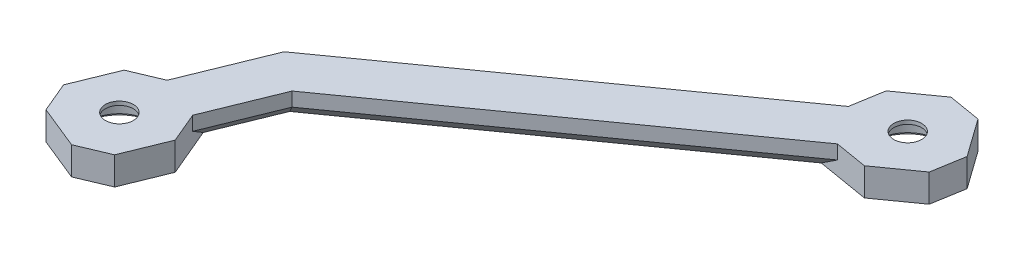
ISO-10303-21;
HEADER;
FILE_DESCRIPTION(('STEP AP214'),'2;1');
FILE_NAME('part.step','',(''),(''),'','','');
FILE_SCHEMA(('AUTOMOTIVE_DESIGN { 1 0 10303 214 1 1 1 1 }'));
ENDSEC;
DATA;
#1=APPLICATION_CONTEXT('core data for automotive mechanical design processes');
#2=APPLICATION_PROTOCOL_DEFINITION('international standard','automotive_design',2000,#1);
#3=PRODUCT_CONTEXT('',#1,'mechanical');
#4=PRODUCT('Part','Part','',(#3));
#5=PRODUCT_RELATED_PRODUCT_CATEGORY('part','',(#4));
#6=PRODUCT_DEFINITION_FORMATION('','',#4);
#7=PRODUCT_DEFINITION_CONTEXT('part definition',#1,'design');
#8=PRODUCT_DEFINITION('design','',#6,#7);
#9=PRODUCT_DEFINITION_SHAPE('','',#8);
#10=(LENGTH_UNIT() NAMED_UNIT(*) SI_UNIT(.MILLI.,.METRE.));
#11=(NAMED_UNIT(*) PLANE_ANGLE_UNIT() SI_UNIT($,.RADIAN.));
#12=(NAMED_UNIT(*) SI_UNIT($,.STERADIAN.) SOLID_ANGLE_UNIT());
#13=UNCERTAINTY_MEASURE_WITH_UNIT(LENGTH_MEASURE(1.E-05),#10,'distance_accuracy_value','');
#14=(GEOMETRIC_REPRESENTATION_CONTEXT(3) GLOBAL_UNCERTAINTY_ASSIGNED_CONTEXT((#13)) GLOBAL_UNIT_ASSIGNED_CONTEXT((#10,
#11,#12)) REPRESENTATION_CONTEXT('',''));
#15=CARTESIAN_POINT('',(0.,0.,0.));
#16=DIRECTION('',(0.,0.,1.));
#17=DIRECTION('',(1.,0.,0.));
#18=AXIS2_PLACEMENT_3D('',#15,#16,#17);
#19=CARTESIAN_POINT('',(17.053694876,-78.000004703,106.083467736));
#20=DIRECTION('',(0.410305024036639,0.707106781063142,0.575890430051425));
#21=DIRECTION('',(0.814432056477463,0.,-0.580258929601165));
#22=AXIS2_PLACEMENT_3D('',#19,#20,#21);
#23=PLANE('',#22);
#24=DIRECTION('',(0.135199918038949,0.577350269166327,-0.805225216231975));
#25=VECTOR('',#24,1.);
#26=CARTESIAN_POINT('',(58.251903788,-81.000004703,80.414501966));
#27=LINE('',#26,#25);
#28=CARTESIAN_POINT('',(58.251903788,-81.000004703,80.414501966));
#29=VERTEX_POINT('',#28);
#30=CARTESIAN_POINT('',(58.954423171,-78.000004703,76.230429008));
#31=VERTEX_POINT('',#30);
#32=EDGE_CURVE('E414',#29,#31,#27,.T.);
#33=ORIENTED_EDGE('',*,*,#32,.F.);
#34=DIRECTION('',(0.814432056937501,0.,-0.580258928955472));
#35=VECTOR('',#34,1.);
#36=CARTESIAN_POINT('',(-9.453065734,-81.000004703,128.65230497));
#37=LINE('',#36,#35);
#38=CARTESIAN_POINT('',(-9.453065734,-81.000004703,128.65230497));
#39=VERTEX_POINT('',#38);
#40=EDGE_CURVE('E355',#39,#29,#37,.T.);
#41=ORIENTED_EDGE('',*,*,#40,.F.);
#42=DIRECTION('',(-0.565776942088541,0.692646805108396,-0.447366578070011));
#43=VECTOR('',#42,1.);
#44=CARTESIAN_POINT('',(-9.453065734,-81.000004703,128.65230497));
#45=LINE('',#44,#43);
#46=CARTESIAN_POINT('',(-11.903565489,-78.000004703,126.714665578));
#47=VERTEX_POINT('',#46);
#48=EDGE_CURVE('E10',#39,#47,#45,.T.);
#49=ORIENTED_EDGE('',*,*,#48,.T.);
#50=DIRECTION('',(-0.814432056937501,0.,0.580258928955472));
#51=VECTOR('',#50,1.);
#52=CARTESIAN_POINT('',(58.954423171,-78.000004703,76.230429008));
#53=LINE('',#52,#51);
#54=EDGE_CURVE('E413',#31,#47,#53,.T.);
#55=ORIENTED_EDGE('',*,*,#54,.F.);
#56=EDGE_LOOP('',(#33,#41,#49,#55));
#57=FACE_BOUND('',#56,.T.);
#58=ADVANCED_FACE('F15',(#57),#23,.F.);
#59=CARTESIAN_POINT('',(-47.202333331,-81.000004703,221.448179913));
#60=DIRECTION('',(-0.654985342169035,-0.707106781182486,-0.266447371068763));
#61=DIRECTION('',(-0.733627816472172,0.679551489512217,0.));
#62=AXIS2_PLACEMENT_3D('',#59,#60,#61);
#63=PLANE('',#62);
#64=DIRECTION('',(0.752346660021994,-0.577350269016878,-0.317239925009274));
#65=VECTOR('',#64,1.);
#66=CARTESIAN_POINT('',(-19.177931217,-78.000004703,144.596631914));
#67=LINE('',#66,#65);
#68=CARTESIAN_POINT('',(-19.177931217,-78.000004703,144.596631914));
#69=VERTEX_POINT('',#68);
#70=CARTESIAN_POINT('',(-15.268623297,-81.000004703,142.948204911));
#71=VERTEX_POINT('',#70);
#72=EDGE_CURVE('E610',#69,#71,#67,.T.);
#73=ORIENTED_EDGE('',*,*,#72,.F.);
#74=DIRECTION('',(-0.376813485990672,0.,0.926289153977071));
#75=VECTOR('',#74,1.);
#76=CARTESIAN_POINT('',(-11.903565489,-78.000004703,126.714665578));
#77=LINE('',#76,#75);
#78=EDGE_CURVE('E405',#47,#69,#77,.T.);
#79=ORIENTED_EDGE('',*,*,#78,.F.);
#80=ORIENTED_EDGE('',*,*,#48,.F.);
#81=DIRECTION('',(0.376813485990672,0.,-0.926289153977071));
#82=VECTOR('',#81,1.);
#83=CARTESIAN_POINT('',(-15.268623297,-81.000004703,142.948204911));
#84=LINE('',#83,#82);
#85=EDGE_CURVE('E307',#71,#39,#84,.T.);
#86=ORIENTED_EDGE('',*,*,#85,.F.);
#87=EDGE_LOOP('',(#73,#79,#80,#86));
#88=FACE_BOUND('',#87,.T.);
#89=ADVANCED_FACE('F689',(#88),#63,.T.);
#90=CARTESIAN_POINT('',(-24.732731248,-81.000004703,144.450016078));
#91=DIRECTION('',(0.410305024036639,-0.707106781063142,0.575890430051425));
#92=DIRECTION('',(-0.8649339752087,-0.501885662805461,0.));
#93=AXIS2_PLACEMENT_3D('',#90,#91,#92);
#94=PLANE('',#93);
#95=DIRECTION('',(-0.805225216231975,-0.577350269166327,-0.135199918038949));
#96=VECTOR('',#95,1.);
#97=CARTESIAN_POINT('',(64.757012463,-78.000004703,84.374749576));
#98=LINE('',#97,#96);
#99=CARTESIAN_POINT('',(64.757012463,-78.000004703,84.374749576));
#100=VERTEX_POINT('',#99);
#101=CARTESIAN_POINT('',(60.572939505,-81.000004703,83.672230193));
#102=VERTEX_POINT('',#101);
#103=EDGE_CURVE('E338',#100,#102,#98,.T.);
#104=ORIENTED_EDGE('',*,*,#103,.F.);
#105=DIRECTION('',(0.814432056937501,0.,-0.580258928955472));
#106=VECTOR('',#105,1.);
#107=CARTESIAN_POINT('',(-3.73523297,-78.000004703,133.173463552));
#108=LINE('',#107,#106);
#109=CARTESIAN_POINT('',(-3.73523297,-78.000004703,133.173463552));
#110=VERTEX_POINT('',#109);
#111=EDGE_CURVE('E373',#110,#100,#108,.T.);
#112=ORIENTED_EDGE('',*,*,#111,.F.);
#113=DIRECTION('',(-0.565776942088541,-0.692646805108396,-0.447366578070011));
#114=VECTOR('',#113,1.);
#115=CARTESIAN_POINT('',(-3.73523297,-78.000004703,133.173463552));
#116=LINE('',#115,#114);
#117=CARTESIAN_POINT('',(-6.185732726,-81.000004703,131.23582416));
#118=VERTEX_POINT('',#117);
#119=EDGE_CURVE('E26',#110,#118,#116,.T.);
#120=ORIENTED_EDGE('',*,*,#119,.T.);
#121=DIRECTION('',(-0.814432056937501,0.,0.580258928955472));
#122=VECTOR('',#121,1.);
#123=CARTESIAN_POINT('',(60.572939505,-81.000004703,83.672230193));
#124=LINE('',#123,#122);
#125=EDGE_CURVE('E358',#102,#118,#124,.T.);
#126=ORIENTED_EDGE('',*,*,#125,.F.);
#127=EDGE_LOOP('',(#104,#112,#120,#126));
#128=FACE_BOUND('',#127,.T.);
#129=ADVANCED_FACE('F794',(#128),#94,.T.);
#130=CARTESIAN_POINT('',(-6.825136324,-78.000004703,140.769115164));
#131=DIRECTION('',(-0.654985342169035,0.707106781182486,-0.266447371068763));
#132=DIRECTION('',(-0.376813485821938,0.,0.926289154045712));
#133=AXIS2_PLACEMENT_3D('',#130,#131,#132);
#134=PLANE('',#133);
#135=DIRECTION('',(0.317239925009274,0.577350269016878,0.752346660021994));
#136=VECTOR('',#135,1.);
#137=CARTESIAN_POINT('',(-11.563466682,-81.000004703,144.455458855));
#138=LINE('',#137,#136);
#139=CARTESIAN_POINT('',(-11.563466682,-81.000004703,144.455458855));
#140=VERTEX_POINT('',#139);
#141=CARTESIAN_POINT('',(-9.915039679,-78.000004703,148.364766776));
#142=VERTEX_POINT('',#141);
#143=EDGE_CURVE('E495',#140,#142,#138,.T.);
#144=ORIENTED_EDGE('',*,*,#143,.F.);
#145=DIRECTION('',(-0.376813485990672,0.,0.926289153977071));
#146=VECTOR('',#145,1.);
#147=CARTESIAN_POINT('',(-6.185732726,-81.000004703,131.23582416));
#148=LINE('',#147,#146);
#149=EDGE_CURVE('E314',#118,#140,#148,.T.);
#150=ORIENTED_EDGE('',*,*,#149,.F.);
#151=ORIENTED_EDGE('',*,*,#119,.F.);
#152=DIRECTION('',(0.376813485990672,0.,-0.926289153977071));
#153=VECTOR('',#152,1.);
#154=CARTESIAN_POINT('',(-9.915039679,-78.000004703,148.364766776));
#155=LINE('',#154,#153);
#156=EDGE_CURVE('E553',#142,#110,#155,.T.);
#157=ORIENTED_EDGE('',*,*,#156,.F.);
#158=EDGE_LOOP('',(#144,#150,#151,#157));
#159=FACE_BOUND('',#158,.T.);
#160=ADVANCED_FACE('F872',(#159),#134,.F.);
#161=CARTESIAN_POINT('',(16.76629373,-75.800004703,368.223362374));
#162=DIRECTION('',(0.,-1.,0.));
#163=DIRECTION('',(0.,0.,-1.));
#164=AXIS2_PLACEMENT_3D('',#161,#162,#163);
#165=PLANE('',#164);
#166=CARTESIAN_POINT('',(-18.31462031,-75.800004703,155.743590884));
#167=DIRECTION('',(0.,-1.,0.));
#168=DIRECTION('',(0.,0.,-1.));
#169=AXIS2_PLACEMENT_3D('',#166,#167,#168);
#170=CIRCLE('',#169,6.75);
#171=CARTESIAN_POINT('',(-18.31462031,-75.800004703,148.993590884));
#172=VERTEX_POINT('',#171);
#173=CARTESIAN_POINT('',(-25.06462031,-75.800004703,155.743590884));
#174=VERTEX_POINT('',#173);
#175=EDGE_CURVE('E424',#172,#174,#170,.T.);
#176=ORIENTED_EDGE('',*,*,#175,.T.);
#177=CARTESIAN_POINT('',(-18.31462031,-75.800004703,155.743590884));
#178=DIRECTION('',(0.,-1.,0.));
#179=DIRECTION('',(0.,0.,-1.));
#180=AXIS2_PLACEMENT_3D('',#177,#178,#179);
#181=CIRCLE('',#180,6.75);
#182=EDGE_CURVE('E39',#174,#172,#181,.T.);
#183=ORIENTED_EDGE('',*,*,#182,.T.);
#184=EDGE_LOOP('',(#176,#183));
#185=FACE_BOUND('',#184,.T.);
#186=CARTESIAN_POINT('',(-18.31462031,-75.800004703,155.743590884));
#187=DIRECTION('',(0.,-1.,0.));
#188=DIRECTION('',(0.,0.,-1.));
#189=AXIS2_PLACEMENT_3D('',#186,#187,#188);
#190=CIRCLE('',#189,3.);
#191=CARTESIAN_POINT('',(-21.31462031,-75.800004703,155.743590884));
#192=VERTEX_POINT('',#191);
#193=CARTESIAN_POINT('',(-18.31462031,-75.800004703,152.743590884));
#194=VERTEX_POINT('',#193);
#195=EDGE_CURVE('E345',#192,#194,#190,.T.);
#196=ORIENTED_EDGE('',*,*,#195,.F.);
#197=CARTESIAN_POINT('',(-18.31462031,-75.800004703,155.743590884));
#198=DIRECTION('',(0.,-1.,0.));
#199=DIRECTION('',(0.,0.,-1.));
#200=AXIS2_PLACEMENT_3D('',#197,#198,#199);
#201=CIRCLE('',#200,3.);
#202=EDGE_CURVE('E584',#194,#192,#201,.T.);
#203=ORIENTED_EDGE('',*,*,#202,.F.);
#204=EDGE_LOOP('',(#196,#203));
#205=FACE_BOUND('',#204,.T.);
#206=ADVANCED_FACE('F17',(#185,#205),#165,.T.);
#207=CARTESIAN_POINT('',(-18.31462031,-80.000004703,155.743590884));
#208=DIRECTION('',(0.,1.,0.));
#209=DIRECTION('',(-1.,0.,0.));
#210=AXIS2_PLACEMENT_3D('',#207,#208,#209);
#211=CYLINDRICAL_SURFACE('',#210,6.75);
#212=DIRECTION('',(0.,-1.,0.));
#213=VECTOR('',#212,1.);
#214=CARTESIAN_POINT('',(-25.06462031,-75.800004703,155.743590884));
#215=LINE('',#214,#213);
#216=CARTESIAN_POINT('',(-25.06462031,-80.000004703,155.743590884));
#217=VERTEX_POINT('',#216);
#218=EDGE_CURVE('E398',#174,#217,#215,.T.);
#219=ORIENTED_EDGE('',*,*,#218,.F.);
#220=ORIENTED_EDGE('',*,*,#175,.F.);
#221=ORIENTED_EDGE('',*,*,#182,.F.);
#222=ORIENTED_EDGE('',*,*,#218,.T.);
#223=CARTESIAN_POINT('',(-18.31462031,-80.000004703,155.743590884));
#224=DIRECTION('',(0.,-1.,0.));
#225=DIRECTION('',(0.,0.,-1.));
#226=AXIS2_PLACEMENT_3D('',#223,#224,#225);
#227=CIRCLE('',#226,6.75);
#228=CARTESIAN_POINT('',(-18.31462031,-80.000004703,148.993590884));
#229=VERTEX_POINT('',#228);
#230=EDGE_CURVE('E297',#217,#229,#227,.T.);
#231=ORIENTED_EDGE('',*,*,#230,.T.);
#232=CARTESIAN_POINT('',(-18.31462031,-80.000004703,155.743590884));
#233=DIRECTION('',(0.,-1.,0.));
#234=DIRECTION('',(0.,0.,-1.));
#235=AXIS2_PLACEMENT_3D('',#232,#233,#234);
#236=CIRCLE('',#235,6.75);
#237=EDGE_CURVE('E502',#229,#217,#236,.T.);
#238=ORIENTED_EDGE('',*,*,#237,.T.);
#239=EDGE_LOOP('',(#219,#220,#221,#222,#231,#238));
#240=FACE_BOUND('',#239,.T.);
#241=ADVANCED_FACE('F917',(#240),#211,.F.);
#242=CARTESIAN_POINT('',(105.080952425,-75.800004703,286.97977149));
#243=DIRECTION('',(0.,-1.,0.));
#244=DIRECTION('',(0.,0.,-1.));
#245=AXIS2_PLACEMENT_3D('',#242,#243,#244);
#246=PLANE('',#245);
#247=CARTESIAN_POINT('',(70.000038384,-75.800004703,74.5));
#248=DIRECTION('',(0.,-1.,0.));
#249=DIRECTION('',(0.,0.,-1.));
#250=AXIS2_PLACEMENT_3D('',#247,#248,#249);
#251=CIRCLE('',#250,6.75);
#252=CARTESIAN_POINT('',(70.000038384,-75.800004703,67.75));
#253=VERTEX_POINT('',#252);
#254=CARTESIAN_POINT('',(63.250038384,-75.800004703,74.5));
#255=VERTEX_POINT('',#254);
#256=EDGE_CURVE('E387',#253,#255,#251,.T.);
#257=ORIENTED_EDGE('',*,*,#256,.T.);
#258=CARTESIAN_POINT('',(70.000038384,-75.800004703,74.5));
#259=DIRECTION('',(0.,-1.,0.));
#260=DIRECTION('',(0.,0.,-1.));
#261=AXIS2_PLACEMENT_3D('',#258,#259,#260);
#262=CIRCLE('',#261,6.75);
#263=EDGE_CURVE('E391',#255,#253,#262,.T.);
#264=ORIENTED_EDGE('',*,*,#263,.T.);
#265=EDGE_LOOP('',(#257,#264));
#266=FACE_BOUND('',#265,.T.);
#267=CARTESIAN_POINT('',(70.000038384,-75.800004703,74.5));
#268=DIRECTION('',(0.,-1.,0.));
#269=DIRECTION('',(0.,0.,-1.));
#270=AXIS2_PLACEMENT_3D('',#267,#268,#269);
#271=CIRCLE('',#270,3.);
#272=CARTESIAN_POINT('',(67.000038384,-75.800004703,74.5));
#273=VERTEX_POINT('',#272);
#274=CARTESIAN_POINT('',(70.000038384,-75.800004703,71.5));
#275=VERTEX_POINT('',#274);
#276=EDGE_CURVE('E368',#273,#275,#271,.T.);
#277=ORIENTED_EDGE('',*,*,#276,.F.);
#278=CARTESIAN_POINT('',(70.000038384,-75.800004703,74.5));
#279=DIRECTION('',(0.,-1.,0.));
#280=DIRECTION('',(0.,0.,-1.));
#281=AXIS2_PLACEMENT_3D('',#278,#279,#280);
#282=CIRCLE('',#281,3.);
#283=EDGE_CURVE('E337',#275,#273,#282,.T.);
#284=ORIENTED_EDGE('',*,*,#283,.F.);
#285=EDGE_LOOP('',(#277,#284));
#286=FACE_BOUND('',#285,.T.);
#287=ADVANCED_FACE('F921',(#266,#286),#246,.T.);
#288=CARTESIAN_POINT('',(70.000038384,-80.000004703,74.5));
#289=DIRECTION('',(0.,1.,0.));
#290=DIRECTION('',(-1.,0.,0.));
#291=AXIS2_PLACEMENT_3D('',#288,#289,#290);
#292=CYLINDRICAL_SURFACE('',#291,6.75);
#293=DIRECTION('',(0.,-1.,0.));
#294=VECTOR('',#293,1.);
#295=CARTESIAN_POINT('',(63.250038384,-75.800004703,74.5));
#296=LINE('',#295,#294);
#297=CARTESIAN_POINT('',(63.250038384,-80.000004703,74.5));
#298=VERTEX_POINT('',#297);
#299=EDGE_CURVE('E386',#255,#298,#296,.T.);
#300=ORIENTED_EDGE('',*,*,#299,.F.);
#301=ORIENTED_EDGE('',*,*,#256,.F.);
#302=ORIENTED_EDGE('',*,*,#263,.F.);
#303=ORIENTED_EDGE('',*,*,#299,.T.);
#304=CARTESIAN_POINT('',(70.000038384,-80.000004703,74.5));
#305=DIRECTION('',(0.,-1.,0.));
#306=DIRECTION('',(0.,0.,-1.));
#307=AXIS2_PLACEMENT_3D('',#304,#305,#306);
#308=CIRCLE('',#307,6.75);
#309=CARTESIAN_POINT('',(70.000038384,-80.000004703,67.75));
#310=VERTEX_POINT('',#309);
#311=EDGE_CURVE('E377',#298,#310,#308,.T.);
#312=ORIENTED_EDGE('',*,*,#311,.T.);
#313=CARTESIAN_POINT('',(70.000038384,-80.000004703,74.5));
#314=DIRECTION('',(0.,-1.,0.));
#315=DIRECTION('',(0.,0.,-1.));
#316=AXIS2_PLACEMENT_3D('',#313,#314,#315);
#317=CIRCLE('',#316,6.75);
#318=EDGE_CURVE('E381',#310,#298,#317,.T.);
#319=ORIENTED_EDGE('',*,*,#318,.T.);
#320=EDGE_LOOP('',(#300,#301,#302,#303,#312,#319));
#321=FACE_BOUND('',#320,.T.);
#322=ADVANCED_FACE('F865',(#321),#292,.F.);
#323=CARTESIAN_POINT('',(105.080952425,-80.000004703,286.97977149));
#324=DIRECTION('',(0.,-1.,0.));
#325=DIRECTION('',(0.,0.,-1.));
#326=AXIS2_PLACEMENT_3D('',#323,#324,#325);
#327=PLANE('',#326);
#328=CARTESIAN_POINT('',(70.000038384,-80.000004703,74.5));
#329=DIRECTION('',(0.,-1.,0.));
#330=DIRECTION('',(0.,0.,-1.));
#331=AXIS2_PLACEMENT_3D('',#328,#329,#330);
#332=CIRCLE('',#331,7.85);
#333=CARTESIAN_POINT('',(70.000038384,-80.000004703,66.65));
#334=VERTEX_POINT('',#333);
#335=CARTESIAN_POINT('',(62.150038384,-80.000004703,74.5));
#336=VERTEX_POINT('',#335);
#337=EDGE_CURVE('E515',#334,#336,#332,.T.);
#338=ORIENTED_EDGE('',*,*,#337,.T.);
#339=CARTESIAN_POINT('',(70.000038384,-80.000004703,74.5));
#340=DIRECTION('',(0.,-1.,0.));
#341=DIRECTION('',(0.,0.,-1.));
#342=AXIS2_PLACEMENT_3D('',#339,#340,#341);
#343=CIRCLE('',#342,7.85);
#344=EDGE_CURVE('E382',#336,#334,#343,.T.);
#345=ORIENTED_EDGE('',*,*,#344,.T.);
#346=EDGE_LOOP('',(#338,#345));
#347=FACE_BOUND('',#346,.T.);
#348=ORIENTED_EDGE('',*,*,#311,.F.);
#349=ORIENTED_EDGE('',*,*,#318,.F.);
#350=EDGE_LOOP('',(#348,#349));
#351=FACE_BOUND('',#350,.T.);
#352=ADVANCED_FACE('F861',(#347,#351),#327,.T.);
#353=CARTESIAN_POINT('',(70.000038384,-81.000004703,74.5));
#354=DIRECTION('',(0.,1.,0.));
#355=DIRECTION('',(-1.,0.,0.));
#356=AXIS2_PLACEMENT_3D('',#353,#354,#355);
#357=CYLINDRICAL_SURFACE('',#356,7.85);
#358=DIRECTION('',(0.,-1.,0.));
#359=VECTOR('',#358,1.);
#360=CARTESIAN_POINT('',(62.150038384,-80.000004703,74.5));
#361=LINE('',#360,#359);
#362=CARTESIAN_POINT('',(62.150038384,-81.000004703,74.5));
#363=VERTEX_POINT('',#362);
#364=EDGE_CURVE('E508',#336,#363,#361,.T.);
#365=ORIENTED_EDGE('',*,*,#364,.F.);
#366=ORIENTED_EDGE('',*,*,#337,.F.);
#367=ORIENTED_EDGE('',*,*,#344,.F.);
#368=ORIENTED_EDGE('',*,*,#364,.T.);
#369=CARTESIAN_POINT('',(70.000038384,-81.000004703,74.5));
#370=DIRECTION('',(0.,-1.,0.));
#371=DIRECTION('',(0.,0.,-1.));
#372=AXIS2_PLACEMENT_3D('',#369,#370,#371);
#373=CIRCLE('',#372,7.85);
#374=CARTESIAN_POINT('',(70.000038384,-81.000004703,66.65));
#375=VERTEX_POINT('',#374);
#376=EDGE_CURVE('E364',#363,#375,#373,.T.);
#377=ORIENTED_EDGE('',*,*,#376,.T.);
#378=CARTESIAN_POINT('',(70.000038384,-81.000004703,74.5));
#379=DIRECTION('',(0.,-1.,0.));
#380=DIRECTION('',(0.,0.,-1.));
#381=AXIS2_PLACEMENT_3D('',#378,#379,#380);
#382=CIRCLE('',#381,7.85);
#383=EDGE_CURVE('E467',#375,#363,#382,.T.);
#384=ORIENTED_EDGE('',*,*,#383,.T.);
#385=EDGE_LOOP('',(#365,#366,#367,#368,#377,#384));
#386=FACE_BOUND('',#385,.T.);
#387=ADVANCED_FACE('F784',(#386),#357,.F.);
#388=CARTESIAN_POINT('',(16.76629373,-80.000004703,368.223362374));
#389=DIRECTION('',(0.,-1.,0.));
#390=DIRECTION('',(0.,0.,-1.));
#391=AXIS2_PLACEMENT_3D('',#388,#389,#390);
#392=PLANE('',#391);
#393=CARTESIAN_POINT('',(-18.31462031,-80.000004703,155.743590884));
#394=DIRECTION('',(0.,-1.,0.));
#395=DIRECTION('',(0.,0.,-1.));
#396=AXIS2_PLACEMENT_3D('',#393,#394,#395);
#397=CIRCLE('',#396,7.85);
#398=CARTESIAN_POINT('',(-18.31462031,-80.000004703,147.893590884));
#399=VERTEX_POINT('',#398);
#400=CARTESIAN_POINT('',(-26.16462031,-80.000004703,155.743590884));
#401=VERTEX_POINT('',#400);
#402=EDGE_CURVE('E19',#399,#401,#397,.T.);
#403=ORIENTED_EDGE('',*,*,#402,.T.);
#404=CARTESIAN_POINT('',(-18.31462031,-80.000004703,155.743590884));
#405=DIRECTION('',(0.,-1.,0.));
#406=DIRECTION('',(0.,0.,-1.));
#407=AXIS2_PLACEMENT_3D('',#404,#405,#406);
#408=CIRCLE('',#407,7.85);
#409=EDGE_CURVE('E290',#401,#399,#408,.T.);
#410=ORIENTED_EDGE('',*,*,#409,.T.);
#411=EDGE_LOOP('',(#403,#410));
#412=FACE_BOUND('',#411,.T.);
#413=ORIENTED_EDGE('',*,*,#230,.F.);
#414=ORIENTED_EDGE('',*,*,#237,.F.);
#415=EDGE_LOOP('',(#413,#414));
#416=FACE_BOUND('',#415,.T.);
#417=ADVANCED_FACE('F292',(#412,#416),#392,.T.);
#418=CARTESIAN_POINT('',(-18.31462031,-81.000004703,155.743590884));
#419=DIRECTION('',(0.,1.,0.));
#420=DIRECTION('',(-1.,0.,0.));
#421=AXIS2_PLACEMENT_3D('',#418,#419,#420);
#422=CYLINDRICAL_SURFACE('',#421,7.85);
#423=DIRECTION('',(0.,-1.,0.));
#424=VECTOR('',#423,1.);
#425=CARTESIAN_POINT('',(-26.16462031,-80.000004703,155.743590884));
#426=LINE('',#425,#424);
#427=CARTESIAN_POINT('',(-26.16462031,-81.000004703,155.743590884));
#428=VERTEX_POINT('',#427);
#429=EDGE_CURVE('E301',#401,#428,#426,.T.);
#430=ORIENTED_EDGE('',*,*,#429,.F.);
#431=ORIENTED_EDGE('',*,*,#402,.F.);
#432=ORIENTED_EDGE('',*,*,#409,.F.);
#433=ORIENTED_EDGE('',*,*,#429,.T.);
#434=CARTESIAN_POINT('',(-18.31462031,-81.000004703,155.743590884));
#435=DIRECTION('',(0.,-1.,0.));
#436=DIRECTION('',(0.,0.,-1.));
#437=AXIS2_PLACEMENT_3D('',#434,#435,#436);
#438=CIRCLE('',#437,7.85);
#439=CARTESIAN_POINT('',(-18.31462031,-81.000004703,147.893590884));
#440=VERTEX_POINT('',#439);
#441=EDGE_CURVE('E488',#428,#440,#438,.T.);
#442=ORIENTED_EDGE('',*,*,#441,.T.);
#443=CARTESIAN_POINT('',(-18.31462031,-81.000004703,155.743590884));
#444=DIRECTION('',(0.,-1.,0.));
#445=DIRECTION('',(0.,0.,-1.));
#446=AXIS2_PLACEMENT_3D('',#443,#444,#445);
#447=CIRCLE('',#446,7.85);
#448=EDGE_CURVE('E359',#440,#428,#447,.T.);
#449=ORIENTED_EDGE('',*,*,#448,.T.);
#450=EDGE_LOOP('',(#430,#431,#432,#433,#442,#449));
#451=FACE_BOUND('',#450,.T.);
#452=ADVANCED_FACE('F299',(#451),#422,.F.);
#453=CARTESIAN_POINT('',(61.68537969,-75.000004703,265.743590884));
#454=DIRECTION('',(0.,-1.,0.));
#455=DIRECTION('',(0.,0.,-1.));
#456=AXIS2_PLACEMENT_3D('',#453,#454,#455);
#457=PLANE('',#456);
#458=CARTESIAN_POINT('',(-18.31462031,-75.000004703,155.743590884));
#459=DIRECTION('',(0.,-1.,0.));
#460=DIRECTION('',(0.,0.,-1.));
#461=AXIS2_PLACEMENT_3D('',#458,#459,#460);
#462=CIRCLE('',#461,3.);
#463=CARTESIAN_POINT('',(-18.31462031,-75.000004703,152.743590884));
#464=VERTEX_POINT('',#463);
#465=CARTESIAN_POINT('',(-21.31462031,-75.000004703,155.743590884));
#466=VERTEX_POINT('',#465);
#467=EDGE_CURVE('E336',#464,#466,#462,.T.);
#468=ORIENTED_EDGE('',*,*,#467,.T.);
#469=CARTESIAN_POINT('',(-18.31462031,-75.000004703,155.743590884));
#470=DIRECTION('',(0.,-1.,0.));
#471=DIRECTION('',(0.,0.,-1.));
#472=AXIS2_PLACEMENT_3D('',#469,#470,#471);
#473=CIRCLE('',#472,3.);
#474=EDGE_CURVE('E342',#466,#464,#473,.T.);
#475=ORIENTED_EDGE('',*,*,#474,.T.);
#476=EDGE_LOOP('',(#468,#475));
#477=FACE_BOUND('',#476,.T.);
#478=CARTESIAN_POINT('',(70.000038384,-75.000004703,74.5));
#479=DIRECTION('',(0.,-1.,0.));
#480=DIRECTION('',(0.,0.,-1.));
#481=AXIS2_PLACEMENT_3D('',#478,#479,#480);
#482=CIRCLE('',#481,3.);
#483=CARTESIAN_POINT('',(70.000038384,-75.000004703,71.5));
#484=VERTEX_POINT('',#483);
#485=CARTESIAN_POINT('',(67.000038384,-75.000004703,74.5));
#486=VERTEX_POINT('',#485);
#487=EDGE_CURVE('E563',#484,#486,#482,.T.);
#488=ORIENTED_EDGE('',*,*,#487,.T.);
#489=CARTESIAN_POINT('',(70.000038384,-75.000004703,74.5));
#490=DIRECTION('',(0.,-1.,0.));
#491=DIRECTION('',(0.,0.,-1.));
#492=AXIS2_PLACEMENT_3D('',#489,#490,#491);
#493=CIRCLE('',#492,3.);
#494=EDGE_CURVE('E459',#486,#484,#493,.T.);
#495=ORIENTED_EDGE('',*,*,#494,.T.);
#496=EDGE_LOOP('',(#488,#495));
#497=FACE_BOUND('',#496,.T.);
#498=DIRECTION('',(-0.580258928955472,0.,-0.814432056937501));
#499=VECTOR('',#498,1.);
#500=CARTESIAN_POINT('',(81.045653598,-75.000004703,72.769570992));
#501=LINE('',#500,#499);
#502=CARTESIAN_POINT('',(81.045653598,-75.000004703,72.769570992));
#503=VERTEX_POINT('',#502);
#504=CARTESIAN_POINT('',(75.243064306,-75.000004703,64.625250424));
#505=VERTEX_POINT('',#504);
#506=EDGE_CURVE('E404',#503,#505,#501,.T.);
#507=ORIENTED_EDGE('',*,*,#506,.T.);
#508=DIRECTION('',(0.986195453915951,0.,0.165585405985888));
#509=VECTOR('',#508,1.);
#510=CARTESIAN_POINT('',(68.269609376,-75.000004703,63.454384786));
#511=LINE('',#510,#509);
#512=CARTESIAN_POINT('',(68.269609376,-75.000004703,63.454384786));
#513=VERTEX_POINT('',#512);
#514=EDGE_CURVE('E365',#513,#505,#511,.T.);
#515=ORIENTED_EDGE('',*,*,#514,.F.);
#516=DIRECTION('',(-0.814432056937501,0.,0.580258928955472));
#517=VECTOR('',#516,1.);
#518=CARTESIAN_POINT('',(68.269609376,-75.000004703,63.454384786));
#519=LINE('',#518,#517);
#520=CARTESIAN_POINT('',(60.125288809,-75.000004703,69.256974078));
#521=VERTEX_POINT('',#520);
#522=EDGE_CURVE('E417',#513,#521,#519,.T.);
#523=ORIENTED_EDGE('',*,*,#522,.T.);
#524=DIRECTION('',(0.165585405985888,0.,-0.986195453915951));
#525=VECTOR('',#524,1.);
#526=CARTESIAN_POINT('',(58.954423171,-75.000004703,76.230429008));
#527=LINE('',#526,#525);
#528=CARTESIAN_POINT('',(58.954423171,-75.000004703,76.230429008));
#529=VERTEX_POINT('',#528);
#530=EDGE_CURVE('E412',#529,#521,#527,.T.);
#531=ORIENTED_EDGE('',*,*,#530,.F.);
#532=DIRECTION('',(-0.814432056937501,0.,0.580258928955472));
#533=VECTOR('',#532,1.);
#534=CARTESIAN_POINT('',(58.954423171,-75.000004703,76.230429008));
#535=LINE('',#534,#533);
#536=CARTESIAN_POINT('',(-11.903565489,-75.000004703,126.714665578));
#537=VERTEX_POINT('',#536);
#538=EDGE_CURVE('E409',#529,#537,#535,.T.);
#539=ORIENTED_EDGE('',*,*,#538,.T.);
#540=DIRECTION('',(0.376813485990672,0.,-0.926289153977071));
#541=VECTOR('',#540,1.);
#542=CARTESIAN_POINT('',(-19.177931217,-75.000004703,144.596631914));
#543=LINE('',#542,#541);
#544=CARTESIAN_POINT('',(-19.177931217,-75.000004703,144.596631914));
#545=VERTEX_POINT('',#544);
#546=EDGE_CURVE('E244',#545,#537,#543,.T.);
#547=ORIENTED_EDGE('',*,*,#546,.F.);
#548=DIRECTION('',(0.921432713232506,0.,-0.388537971098041));
#549=VECTOR('',#548,1.);
#550=CARTESIAN_POINT('',(-25.693444418,-75.000004703,147.344010252));
#551=LINE('',#550,#549);
#552=CARTESIAN_POINT('',(-25.693444418,-75.000004703,147.344010252));
#553=VERTEX_POINT('',#552);
#554=EDGE_CURVE('E539',#553,#545,#551,.T.);
#555=ORIENTED_EDGE('',*,*,#554,.F.);
#556=DIRECTION('',(0.376813485990672,0.,-0.926289153977071));
#557=VECTOR('',#556,1.);
#558=CARTESIAN_POINT('',(-29.46157928,-75.000004703,156.606901791));
#559=LINE('',#558,#557);
#560=CARTESIAN_POINT('',(-29.46157928,-75.000004703,156.606901791));
#561=VERTEX_POINT('',#560);
#562=EDGE_CURVE('E326',#561,#553,#559,.T.);
#563=ORIENTED_EDGE('',*,*,#562,.F.);
#564=DIRECTION('',(0.388537971098041,0.,0.921432713232506));
#565=VECTOR('',#564,1.);
#566=CARTESIAN_POINT('',(-29.46157928,-75.000004703,156.606901791));
#567=LINE('',#566,#565);
#568=CARTESIAN_POINT('',(-26.714200942,-75.000004703,163.122414991));
#569=VERTEX_POINT('',#568);
#570=EDGE_CURVE('E346',#561,#569,#567,.T.);
#571=ORIENTED_EDGE('',*,*,#570,.T.);
#572=DIRECTION('',(0.926289153977071,0.,0.376813485990672));
#573=VECTOR('',#572,1.);
#574=CARTESIAN_POINT('',(-26.714200942,-75.000004703,163.122414991));
#575=LINE('',#574,#573);
#576=CARTESIAN_POINT('',(-17.451309403,-75.000004703,166.890549854));
#577=VERTEX_POINT('',#576);
#578=EDGE_CURVE('E325',#569,#577,#575,.T.);
#579=ORIENTED_EDGE('',*,*,#578,.T.);
#580=DIRECTION('',(-0.921432713232506,0.,0.388537971098041));
#581=VECTOR('',#580,1.);
#582=CARTESIAN_POINT('',(-10.935796202,-75.000004703,164.143171515));
#583=LINE('',#582,#581);
#584=CARTESIAN_POINT('',(-10.935796202,-75.000004703,164.143171515));
#585=VERTEX_POINT('',#584);
#586=EDGE_CURVE('E395',#585,#577,#583,.T.);
#587=ORIENTED_EDGE('',*,*,#586,.F.);
#588=DIRECTION('',(0.376813485990672,0.,-0.926289153977071));
#589=VECTOR('',#588,1.);
#590=CARTESIAN_POINT('',(-10.935796202,-75.000004703,164.143171515));
#591=LINE('',#590,#589);
#592=CARTESIAN_POINT('',(-7.16766134,-75.000004703,154.880279976));
#593=VERTEX_POINT('',#592);
#594=EDGE_CURVE('E477',#585,#593,#591,.T.);
#595=ORIENTED_EDGE('',*,*,#594,.T.);
#596=DIRECTION('',(0.388537971098041,0.,0.921432713232506));
#597=VECTOR('',#596,1.);
#598=CARTESIAN_POINT('',(-9.915039679,-75.000004703,148.364766776));
#599=LINE('',#598,#597);
#600=CARTESIAN_POINT('',(-9.915039679,-75.000004703,148.364766776));
#601=VERTEX_POINT('',#600);
#602=EDGE_CURVE('E505',#601,#593,#599,.T.);
#603=ORIENTED_EDGE('',*,*,#602,.F.);
#604=DIRECTION('',(0.376813485990672,0.,-0.926289153977071));
#605=VECTOR('',#604,1.);
#606=CARTESIAN_POINT('',(-9.915039679,-75.000004703,148.364766776));
#607=LINE('',#606,#605);
#608=CARTESIAN_POINT('',(-3.73523297,-75.000004703,133.173463552));
#609=VERTEX_POINT('',#608);
#610=EDGE_CURVE('E546',#601,#609,#607,.T.);
#611=ORIENTED_EDGE('',*,*,#610,.T.);
#612=DIRECTION('',(-0.814432056937501,0.,0.580258928955472));
#613=VECTOR('',#612,1.);
#614=CARTESIAN_POINT('',(64.757012463,-75.000004703,84.374749576));
#615=LINE('',#614,#613);
#616=CARTESIAN_POINT('',(64.757012463,-75.000004703,84.374749576));
#617=VERTEX_POINT('',#616);
#618=EDGE_CURVE('E130',#617,#609,#615,.T.);
#619=ORIENTED_EDGE('',*,*,#618,.F.);
#620=DIRECTION('',(0.986195453915951,0.,0.165585405985888));
#621=VECTOR('',#620,1.);
#622=CARTESIAN_POINT('',(64.757012463,-75.000004703,84.374749576));
#623=LINE('',#622,#621);
#624=CARTESIAN_POINT('',(71.730467392,-75.000004703,85.545615214));
#625=VERTEX_POINT('',#624);
#626=EDGE_CURVE('E442',#617,#625,#623,.T.);
#627=ORIENTED_EDGE('',*,*,#626,.T.);
#628=DIRECTION('',(-0.814432056937501,0.,0.580258928955472));
#629=VECTOR('',#628,1.);
#630=CARTESIAN_POINT('',(79.87478796,-75.000004703,79.743025922));
#631=LINE('',#630,#629);
#632=CARTESIAN_POINT('',(79.87478796,-75.000004703,79.743025922));
#633=VERTEX_POINT('',#632);
#634=EDGE_CURVE('E433',#633,#625,#631,.T.);
#635=ORIENTED_EDGE('',*,*,#634,.F.);
#636=DIRECTION('',(-0.165585405985888,0.,0.986195453915951));
#637=VECTOR('',#636,1.);
#638=CARTESIAN_POINT('',(81.045653598,-75.000004703,72.769570992));
#639=LINE('',#638,#637);
#640=EDGE_CURVE('E432',#503,#633,#639,.T.);
#641=ORIENTED_EDGE('',*,*,#640,.F.);
#642=EDGE_LOOP('',(#507,#515,#523,#531,#539,#547,#555,#563,#571,#579,#587,#595,#603,#611,#619,
#627,#635,#641));
#643=FACE_BOUND('',#642,.T.);
#644=ADVANCED_FACE('F804',(#477,#497,#643),#457,.F.);
#645=CARTESIAN_POINT('',(61.68537969,-81.000004703,265.743590884));
#646=DIRECTION('',(0.,-1.,0.));
#647=DIRECTION('',(0.,0.,-1.));
#648=AXIS2_PLACEMENT_3D('',#645,#646,#647);
#649=PLANE('',#648);
#650=ORIENTED_EDGE('',*,*,#40,.T.);
#651=DIRECTION('',(0.165585405985888,0.,-0.986195453915951));
#652=VECTOR('',#651,1.);
#653=CARTESIAN_POINT('',(58.251903788,-81.000004703,80.414501966));
#654=LINE('',#653,#652);
#655=CARTESIAN_POINT('',(60.125288809,-81.000004703,69.256974078));
#656=VERTEX_POINT('',#655);
#657=EDGE_CURVE('E418',#29,#656,#654,.T.);
#658=ORIENTED_EDGE('',*,*,#657,.T.);
#659=DIRECTION('',(-0.814432056937501,0.,0.580258928955472));
#660=VECTOR('',#659,1.);
#661=CARTESIAN_POINT('',(68.269609376,-81.000004703,63.454384786));
#662=LINE('',#661,#660);
#663=CARTESIAN_POINT('',(68.269609376,-81.000004703,63.454384786));
#664=VERTEX_POINT('',#663);
#665=EDGE_CURVE('E452',#664,#656,#662,.T.);
#666=ORIENTED_EDGE('',*,*,#665,.F.);
#667=DIRECTION('',(0.986195453915951,0.,0.165585405985888));
#668=VECTOR('',#667,1.);
#669=CARTESIAN_POINT('',(68.269609376,-81.000004703,63.454384786));
#670=LINE('',#669,#668);
#671=CARTESIAN_POINT('',(75.243064306,-81.000004703,64.625250424));
#672=VERTEX_POINT('',#671);
#673=EDGE_CURVE('E360',#664,#672,#670,.T.);
#674=ORIENTED_EDGE('',*,*,#673,.T.);
#675=DIRECTION('',(-0.580258928955472,0.,-0.814432056937501));
#676=VECTOR('',#675,1.);
#677=CARTESIAN_POINT('',(81.045653598,-81.000004703,72.769570992));
#678=LINE('',#677,#676);
#679=CARTESIAN_POINT('',(81.045653598,-81.000004703,72.769570992));
#680=VERTEX_POINT('',#679);
#681=EDGE_CURVE('E403',#680,#672,#678,.T.);
#682=ORIENTED_EDGE('',*,*,#681,.F.);
#683=DIRECTION('',(-0.165585405985888,0.,0.986195453915951));
#684=VECTOR('',#683,1.);
#685=CARTESIAN_POINT('',(81.045653598,-81.000004703,72.769570992));
#686=LINE('',#685,#684);
#687=CARTESIAN_POINT('',(79.87478796,-81.000004703,79.743025922));
#688=VERTEX_POINT('',#687);
#689=EDGE_CURVE('E438',#680,#688,#686,.T.);
#690=ORIENTED_EDGE('',*,*,#689,.T.);
#691=DIRECTION('',(-0.814432056937501,0.,0.580258928955472));
#692=VECTOR('',#691,1.);
#693=CARTESIAN_POINT('',(79.87478796,-81.000004703,79.743025922));
#694=LINE('',#693,#692);
#695=CARTESIAN_POINT('',(71.730467392,-81.000004703,85.545615214));
#696=VERTEX_POINT('',#695);
#697=EDGE_CURVE('E439',#688,#696,#694,.T.);
#698=ORIENTED_EDGE('',*,*,#697,.T.);
#699=DIRECTION('',(0.986195453915951,0.,0.165585405985888));
#700=VECTOR('',#699,1.);
#701=CARTESIAN_POINT('',(60.572939505,-81.000004703,83.672230193));
#702=LINE('',#701,#700);
#703=EDGE_CURVE('E143',#102,#696,#702,.T.);
#704=ORIENTED_EDGE('',*,*,#703,.F.);
#705=ORIENTED_EDGE('',*,*,#125,.T.);
#706=ORIENTED_EDGE('',*,*,#149,.T.);
#707=DIRECTION('',(0.388537971098041,0.,0.921432713232506));
#708=VECTOR('',#707,1.);
#709=CARTESIAN_POINT('',(-11.563466682,-81.000004703,144.455458855));
#710=LINE('',#709,#708);
#711=CARTESIAN_POINT('',(-7.16766134,-81.000004703,154.880279976));
#712=VERTEX_POINT('',#711);
#713=EDGE_CURVE('E491',#140,#712,#710,.T.);
#714=ORIENTED_EDGE('',*,*,#713,.T.);
#715=DIRECTION('',(0.376813485990672,0.,-0.926289153977071));
#716=VECTOR('',#715,1.);
#717=CARTESIAN_POINT('',(-10.935796202,-81.000004703,164.143171515));
#718=LINE('',#717,#716);
#719=CARTESIAN_POINT('',(-10.935796202,-81.000004703,164.143171515));
#720=VERTEX_POINT('',#719);
#721=EDGE_CURVE('E463',#720,#712,#718,.T.);
#722=ORIENTED_EDGE('',*,*,#721,.F.);
#723=DIRECTION('',(-0.921432713232506,0.,0.388537971098041));
#724=VECTOR('',#723,1.);
#725=CARTESIAN_POINT('',(-10.935796202,-81.000004703,164.143171515));
#726=LINE('',#725,#724);
#727=CARTESIAN_POINT('',(-17.451309403,-81.000004703,166.890549854));
#728=VERTEX_POINT('',#727);
#729=EDGE_CURVE('E350',#720,#728,#726,.T.);
#730=ORIENTED_EDGE('',*,*,#729,.T.);
#731=DIRECTION('',(0.926289153977071,0.,0.376813485990672));
#732=VECTOR('',#731,1.);
#733=CARTESIAN_POINT('',(-26.714200942,-81.000004703,163.122414991));
#734=LINE('',#733,#732);
#735=CARTESIAN_POINT('',(-26.714200942,-81.000004703,163.122414991));
#736=VERTEX_POINT('',#735);
#737=EDGE_CURVE('E324',#736,#728,#734,.T.);
#738=ORIENTED_EDGE('',*,*,#737,.F.);
#739=DIRECTION('',(0.388537971098041,0.,0.921432713232506));
#740=VECTOR('',#739,1.);
#741=CARTESIAN_POINT('',(-29.46157928,-81.000004703,156.606901791));
#742=LINE('',#741,#740);
#743=CARTESIAN_POINT('',(-29.46157928,-81.000004703,156.606901791));
#744=VERTEX_POINT('',#743);
#745=EDGE_CURVE('E331',#744,#736,#742,.T.);
#746=ORIENTED_EDGE('',*,*,#745,.F.);
#747=DIRECTION('',(0.376813485990672,0.,-0.926289153977071));
#748=VECTOR('',#747,1.);
#749=CARTESIAN_POINT('',(-29.46157928,-81.000004703,156.606901791));
#750=LINE('',#749,#748);
#751=CARTESIAN_POINT('',(-25.693444418,-81.000004703,147.344010252));
#752=VERTEX_POINT('',#751);
#753=EDGE_CURVE('E426',#744,#752,#750,.T.);
#754=ORIENTED_EDGE('',*,*,#753,.T.);
#755=DIRECTION('',(0.921432713232506,0.,-0.388537971098041));
#756=VECTOR('',#755,1.);
#757=CARTESIAN_POINT('',(-25.693444418,-81.000004703,147.344010252));
#758=LINE('',#757,#756);
#759=EDGE_CURVE('E234',#752,#71,#758,.T.);
#760=ORIENTED_EDGE('',*,*,#759,.T.);
#761=ORIENTED_EDGE('',*,*,#85,.T.);
#762=EDGE_LOOP('',(#650,#658,#666,#674,#682,#690,#698,#704,#705,#706,#714,#722,#730,#738,#746,
#754,#760,#761));
#763=FACE_BOUND('',#762,.T.);
#764=ORIENTED_EDGE('',*,*,#441,.F.);
#765=ORIENTED_EDGE('',*,*,#448,.F.);
#766=EDGE_LOOP('',(#764,#765));
#767=FACE_BOUND('',#766,.T.);
#768=ORIENTED_EDGE('',*,*,#376,.F.);
#769=ORIENTED_EDGE('',*,*,#383,.F.);
#770=EDGE_LOOP('',(#768,#769));
#771=FACE_BOUND('',#770,.T.);
#772=ADVANCED_FACE('F662',(#763,#767,#771),#649,.T.);
#773=CARTESIAN_POINT('',(71.756336841,-81.000004703,64.039817605));
#774=DIRECTION('',(-0.165585405985888,0.,0.986195453915951));
#775=DIRECTION('',(0.,1.,0.));
#776=AXIS2_PLACEMENT_3D('',#773,#774,#775);
#777=PLANE('',#776);
#778=ORIENTED_EDGE('',*,*,#514,.T.);
#779=DIRECTION('',(0.,1.,0.));
#780=VECTOR('',#779,1.);
#781=CARTESIAN_POINT('',(75.243064306,-81.000004703,64.625250424));
#782=LINE('',#781,#780);
#783=EDGE_CURVE('E428',#672,#505,#782,.T.);
#784=ORIENTED_EDGE('',*,*,#783,.F.);
#785=ORIENTED_EDGE('',*,*,#673,.F.);
#786=DIRECTION('',(0.,1.,0.));
#787=VECTOR('',#786,1.);
#788=CARTESIAN_POINT('',(68.269609376,-81.000004703,63.454384786));
#789=LINE('',#788,#787);
#790=EDGE_CURVE('E455',#664,#513,#789,.T.);
#791=ORIENTED_EDGE('',*,*,#790,.T.);
#792=EDGE_LOOP('',(#778,#784,#785,#791));
#793=FACE_BOUND('',#792,.T.);
#794=ADVANCED_FACE('F803',(#793),#777,.F.);
#795=CARTESIAN_POINT('',(24.104858672,-81.000004703,94.920473011));
#796=DIRECTION('',(-0.580258928955472,0.,-0.814432056937501));
#797=DIRECTION('',(-0.814432056937501,0.,0.580258928955472));
#798=AXIS2_PLACEMENT_3D('',#795,#796,#797);
#799=PLANE('',#798);
#800=ORIENTED_EDGE('',*,*,#522,.F.);
#801=ORIENTED_EDGE('',*,*,#790,.F.);
#802=ORIENTED_EDGE('',*,*,#665,.T.);
#803=DIRECTION('',(0.,1.,0.));
#804=VECTOR('',#803,1.);
#805=CARTESIAN_POINT('',(60.125288809,-81.000004703,69.256974078));
#806=LINE('',#805,#804);
#807=EDGE_CURVE('E550',#656,#521,#806,.T.);
#808=ORIENTED_EDGE('',*,*,#807,.T.);
#809=EDGE_LOOP('',(#800,#801,#802,#808));
#810=FACE_BOUND('',#809,.T.);
#811=ADVANCED_FACE('F839',(#810),#799,.T.);
#812=CARTESIAN_POINT('',(59.53985599,-81.000004703,72.743701543));
#813=DIRECTION('',(0.986195453915951,0.,0.165585405985888));
#814=DIRECTION('',(0.,-1.,0.));
#815=AXIS2_PLACEMENT_3D('',#812,#813,#814);
#816=PLANE('',#815);
#817=ORIENTED_EDGE('',*,*,#530,.T.);
#818=ORIENTED_EDGE('',*,*,#807,.F.);
#819=ORIENTED_EDGE('',*,*,#657,.F.);
#820=ORIENTED_EDGE('',*,*,#32,.T.);
#821=DIRECTION('',(0.,1.,0.));
#822=VECTOR('',#821,1.);
#823=CARTESIAN_POINT('',(58.954423171,-78.000004703,76.230429008));
#824=LINE('',#823,#822);
#825=EDGE_CURVE('E532',#31,#529,#824,.T.);
#826=ORIENTED_EDGE('',*,*,#825,.T.);
#827=EDGE_LOOP('',(#817,#818,#819,#820,#826));
#828=FACE_BOUND('',#827,.T.);
#829=ADVANCED_FACE('F843',(#828),#816,.F.);
#830=CARTESIAN_POINT('',(17.053694876,-81.000004703,106.083467736));
#831=DIRECTION('',(-0.580258928955472,0.,-0.814432056937501));
#832=DIRECTION('',(-0.814432056937501,0.,0.580258928955472));
#833=AXIS2_PLACEMENT_3D('',#830,#831,#832);
#834=PLANE('',#833);
#835=ORIENTED_EDGE('',*,*,#825,.F.);
#836=ORIENTED_EDGE('',*,*,#54,.T.);
#837=DIRECTION('',(0.,1.,0.));
#838=VECTOR('',#837,1.);
#839=CARTESIAN_POINT('',(-11.903565489,-78.000004703,126.714665578));
#840=LINE('',#839,#838);
#841=EDGE_CURVE('E408',#47,#537,#840,.T.);
#842=ORIENTED_EDGE('',*,*,#841,.T.);
#843=ORIENTED_EDGE('',*,*,#538,.F.);
#844=EDGE_LOOP('',(#835,#836,#842,#843));
#845=FACE_BOUND('',#844,.T.);
#846=ADVANCED_FACE('F696',(#845),#834,.T.);
#847=CARTESIAN_POINT('',(-15.540748353,-81.000004703,135.655648746));
#848=DIRECTION('',(0.926289153977071,0.,0.376813485990672));
#849=DIRECTION('',(0.,-1.,0.));
#850=AXIS2_PLACEMENT_3D('',#847,#848,#849);
#851=PLANE('',#850);
#852=ORIENTED_EDGE('',*,*,#841,.F.);
#853=ORIENTED_EDGE('',*,*,#78,.T.);
#854=DIRECTION('',(0.,1.,0.));
#855=VECTOR('',#854,1.);
#856=CARTESIAN_POINT('',(-19.177931217,-78.000004703,144.596631914));
#857=LINE('',#856,#855);
#858=EDGE_CURVE('E318',#69,#545,#857,.T.);
#859=ORIENTED_EDGE('',*,*,#858,.T.);
#860=ORIENTED_EDGE('',*,*,#546,.T.);
#861=EDGE_LOOP('',(#852,#853,#859,#860));
#862=FACE_BOUND('',#861,.T.);
#863=ADVANCED_FACE('F949',(#862),#851,.F.);
#864=CARTESIAN_POINT('',(-22.435687818,-81.000004703,145.970321083));
#865=DIRECTION('',(0.388537971098041,0.,0.921432713232506));
#866=DIRECTION('',(0.,-1.,0.));
#867=AXIS2_PLACEMENT_3D('',#864,#865,#866);
#868=PLANE('',#867);
#869=ORIENTED_EDGE('',*,*,#554,.T.);
#870=ORIENTED_EDGE('',*,*,#858,.F.);
#871=ORIENTED_EDGE('',*,*,#72,.T.);
#872=ORIENTED_EDGE('',*,*,#759,.F.);
#873=DIRECTION('',(0.,1.,0.));
#874=VECTOR('',#873,1.);
#875=CARTESIAN_POINT('',(-25.693444418,-81.000004703,147.344010252));
#876=LINE('',#875,#874);
#877=EDGE_CURVE('E330',#752,#553,#876,.T.);
#878=ORIENTED_EDGE('',*,*,#877,.T.);
#879=EDGE_LOOP('',(#869,#870,#871,#872,#878));
#880=FACE_BOUND('',#879,.T.);
#881=ADVANCED_FACE('F686',(#880),#868,.F.);
#882=CARTESIAN_POINT('',(-18.550446103,-81.000004703,129.784973467));
#883=DIRECTION('',(0.926289153977071,0.,0.376813485990672));
#884=DIRECTION('',(0.,-1.,0.));
#885=AXIS2_PLACEMENT_3D('',#882,#883,#884);
#886=PLANE('',#885);
#887=ORIENTED_EDGE('',*,*,#562,.T.);
#888=ORIENTED_EDGE('',*,*,#877,.F.);
#889=ORIENTED_EDGE('',*,*,#753,.F.);
#890=DIRECTION('',(0.,1.,0.));
#891=VECTOR('',#890,1.);
#892=CARTESIAN_POINT('',(-29.46157928,-81.000004703,156.606901791));
#893=LINE('',#892,#891);
#894=EDGE_CURVE('E349',#744,#561,#893,.T.);
#895=ORIENTED_EDGE('',*,*,#894,.T.);
#896=EDGE_LOOP('',(#887,#888,#889,#895));
#897=FACE_BOUND('',#896,.T.);
#898=ADVANCED_FACE('F829',(#897),#886,.F.);
#899=CARTESIAN_POINT('',(-28.087890111,-81.000004703,159.864658391));
#900=DIRECTION('',(-0.921432713232506,0.,0.388537971098041));
#901=DIRECTION('',(0.,1.,0.));
#902=AXIS2_PLACEMENT_3D('',#899,#900,#901);
#903=PLANE('',#902);
#904=ORIENTED_EDGE('',*,*,#570,.F.);
#905=ORIENTED_EDGE('',*,*,#894,.F.);
#906=ORIENTED_EDGE('',*,*,#745,.T.);
#907=DIRECTION('',(0.,1.,0.));
#908=VECTOR('',#907,1.);
#909=CARTESIAN_POINT('',(-26.714200942,-81.000004703,163.122414991));
#910=LINE('',#909,#908);
#911=EDGE_CURVE('E320',#736,#569,#910,.T.);
#912=ORIENTED_EDGE('',*,*,#911,.T.);
#913=EDGE_LOOP('',(#904,#905,#906,#912));
#914=FACE_BOUND('',#913,.T.);
#915=ADVANCED_FACE('F814',(#914),#903,.T.);
#916=CARTESIAN_POINT('',(-19.767032287,-81.000004703,165.948516138));
#917=DIRECTION('',(-0.376813485990672,0.,0.926289153977071));
#918=DIRECTION('',(0.,1.,0.));
#919=AXIS2_PLACEMENT_3D('',#916,#917,#918);
#920=PLANE('',#919);
#921=ORIENTED_EDGE('',*,*,#578,.F.);
#922=ORIENTED_EDGE('',*,*,#911,.F.);
#923=ORIENTED_EDGE('',*,*,#737,.T.);
#924=DIRECTION('',(0.,1.,0.));
#925=VECTOR('',#924,1.);
#926=CARTESIAN_POINT('',(-17.451309403,-81.000004703,166.890549854));
#927=LINE('',#926,#925);
#928=EDGE_CURVE('E354',#728,#577,#927,.T.);
#929=ORIENTED_EDGE('',*,*,#928,.T.);
#930=EDGE_LOOP('',(#921,#922,#923,#929));
#931=FACE_BOUND('',#930,.T.);
#932=ADVANCED_FACE('F810',(#931),#920,.T.);
#933=CARTESIAN_POINT('',(-14.193552803,-81.000004703,165.516860684));
#934=DIRECTION('',(-0.388537971098041,0.,-0.921432713232506));
#935=DIRECTION('',(-0.921432713232506,0.,0.388537971098041));
#936=AXIS2_PLACEMENT_3D('',#933,#934,#935);
#937=PLANE('',#936);
#938=ORIENTED_EDGE('',*,*,#586,.T.);
#939=ORIENTED_EDGE('',*,*,#928,.F.);
#940=ORIENTED_EDGE('',*,*,#729,.F.);
#941=DIRECTION('',(0.,1.,0.));
#942=VECTOR('',#941,1.);
#943=CARTESIAN_POINT('',(-10.935796202,-81.000004703,164.143171515));
#944=LINE('',#943,#942);
#945=EDGE_CURVE('E473',#720,#585,#944,.T.);
#946=ORIENTED_EDGE('',*,*,#945,.T.);
#947=EDGE_LOOP('',(#938,#939,#940,#946));
#948=FACE_BOUND('',#947,.T.);
#949=ADVANCED_FACE('F657',(#948),#937,.F.);
#950=CARTESIAN_POINT('',(-0.024663025,-81.000004703,137.321243191));
#951=DIRECTION('',(0.926289153977071,0.,0.376813485990672));
#952=DIRECTION('',(0.,-1.,0.));
#953=AXIS2_PLACEMENT_3D('',#950,#951,#952);
#954=PLANE('',#953);
#955=ORIENTED_EDGE('',*,*,#594,.F.);
#956=ORIENTED_EDGE('',*,*,#945,.F.);
#957=ORIENTED_EDGE('',*,*,#721,.T.);
#958=DIRECTION('',(0.,1.,0.));
#959=VECTOR('',#958,1.);
#960=CARTESIAN_POINT('',(-7.16766134,-81.000004703,154.880279976));
#961=LINE('',#960,#959);
#962=EDGE_CURVE('E496',#712,#593,#961,.T.);
#963=ORIENTED_EDGE('',*,*,#962,.T.);
#964=EDGE_LOOP('',(#955,#956,#957,#963));
#965=FACE_BOUND('',#964,.T.);
#966=ADVANCED_FACE('F665',(#965),#954,.T.);
#967=CARTESIAN_POINT('',(-8.541350509,-81.000004703,151.622523376));
#968=DIRECTION('',(-0.921432713232506,0.,0.388537971098041));
#969=DIRECTION('',(0.,1.,0.));
#970=AXIS2_PLACEMENT_3D('',#967,#968,#969);
#971=PLANE('',#970);
#972=ORIENTED_EDGE('',*,*,#602,.T.);
#973=ORIENTED_EDGE('',*,*,#962,.F.);
#974=ORIENTED_EDGE('',*,*,#713,.F.);
#975=ORIENTED_EDGE('',*,*,#143,.T.);
#976=DIRECTION('',(0.,1.,0.));
#977=VECTOR('',#976,1.);
#978=CARTESIAN_POINT('',(-9.915039679,-78.000004703,148.364766776));
#979=LINE('',#978,#977);
#980=EDGE_CURVE('E472',#142,#601,#979,.T.);
#981=ORIENTED_EDGE('',*,*,#980,.T.);
#982=EDGE_LOOP('',(#972,#973,#974,#975,#981));
#983=FACE_BOUND('',#982,.T.);
#984=ADVANCED_FACE('F618',(#983),#971,.F.);
#985=CARTESIAN_POINT('',(-6.825136324,-81.000004703,140.769115164));
#986=DIRECTION('',(0.926289153977071,0.,0.376813485990672));
#987=DIRECTION('',(0.,-1.,0.));
#988=AXIS2_PLACEMENT_3D('',#985,#986,#987);
#989=PLANE('',#988);
#990=ORIENTED_EDGE('',*,*,#980,.F.);
#991=ORIENTED_EDGE('',*,*,#156,.T.);
#992=DIRECTION('',(0.,1.,0.));
#993=VECTOR('',#992,1.);
#994=CARTESIAN_POINT('',(-3.73523297,-78.000004703,133.173463552));
#995=LINE('',#994,#993);
#996=EDGE_CURVE('E369',#110,#609,#995,.T.);
#997=ORIENTED_EDGE('',*,*,#996,.T.);
#998=ORIENTED_EDGE('',*,*,#610,.F.);
#999=EDGE_LOOP('',(#990,#991,#997,#998));
#1000=FACE_BOUND('',#999,.T.);
#1001=ADVANCED_FACE('F628',(#1000),#989,.T.);
#1002=CARTESIAN_POINT('',(-3.73523297,-81.000004703,133.173463552));
#1003=DIRECTION('',(-0.580258928955472,0.,-0.814432056937501));
#1004=DIRECTION('',(-0.814432056937501,0.,0.580258928955472));
#1005=AXIS2_PLACEMENT_3D('',#1002,#1003,#1004);
#1006=PLANE('',#1005);
#1007=ORIENTED_EDGE('',*,*,#996,.F.);
#1008=ORIENTED_EDGE('',*,*,#111,.T.);
#1009=DIRECTION('',(0.,1.,0.));
#1010=VECTOR('',#1009,1.);
#1011=CARTESIAN_POINT('',(64.757012463,-78.000004703,84.374749576));
#1012=LINE('',#1011,#1010);
#1013=EDGE_CURVE('E341',#100,#617,#1012,.T.);
#1014=ORIENTED_EDGE('',*,*,#1013,.T.);
#1015=ORIENTED_EDGE('',*,*,#618,.T.);
#1016=EDGE_LOOP('',(#1007,#1008,#1014,#1015));
#1017=FACE_BOUND('',#1016,.T.);
#1018=ADVANCED_FACE('F855',(#1017),#1006,.F.);
#1019=CARTESIAN_POINT('',(68.243739928,-81.000004703,84.960182395));
#1020=DIRECTION('',(-0.165585405985888,0.,0.986195453915951));
#1021=DIRECTION('',(0.,1.,0.));
#1022=AXIS2_PLACEMENT_3D('',#1019,#1020,#1021);
#1023=PLANE('',#1022);
#1024=ORIENTED_EDGE('',*,*,#626,.F.);
#1025=ORIENTED_EDGE('',*,*,#1013,.F.);
#1026=ORIENTED_EDGE('',*,*,#103,.T.);
#1027=ORIENTED_EDGE('',*,*,#703,.T.);
#1028=DIRECTION('',(0.,1.,0.));
#1029=VECTOR('',#1028,1.);
#1030=CARTESIAN_POINT('',(71.730467392,-81.000004703,85.545615214));
#1031=LINE('',#1030,#1029);
#1032=EDGE_CURVE('E437',#696,#625,#1031,.T.);
#1033=ORIENTED_EDGE('',*,*,#1032,.T.);
#1034=EDGE_LOOP('',(#1024,#1025,#1026,#1027,#1033));
#1035=FACE_BOUND('',#1034,.T.);
#1036=ADVANCED_FACE('F850',(#1035),#1023,.T.);
#1037=CARTESIAN_POINT('',(38.075780483,-81.000004703,109.523591554));
#1038=DIRECTION('',(-0.580258928955472,0.,-0.814432056937501));
#1039=DIRECTION('',(-0.814432056937501,0.,0.580258928955472));
#1040=AXIS2_PLACEMENT_3D('',#1037,#1038,#1039);
#1041=PLANE('',#1040);
#1042=ORIENTED_EDGE('',*,*,#634,.T.);
#1043=ORIENTED_EDGE('',*,*,#1032,.F.);
#1044=ORIENTED_EDGE('',*,*,#697,.F.);
#1045=DIRECTION('',(0.,1.,0.));
#1046=VECTOR('',#1045,1.);
#1047=CARTESIAN_POINT('',(79.87478796,-81.000004703,79.743025922));
#1048=LINE('',#1047,#1046);
#1049=EDGE_CURVE('E560',#688,#633,#1048,.T.);
#1050=ORIENTED_EDGE('',*,*,#1049,.T.);
#1051=EDGE_LOOP('',(#1042,#1043,#1044,#1050));
#1052=FACE_BOUND('',#1051,.T.);
#1053=ADVANCED_FACE('F854',(#1052),#1041,.F.);
#1054=CARTESIAN_POINT('',(80.460220779,-81.000004703,76.256298457));
#1055=DIRECTION('',(-0.986195453915951,0.,-0.165585405985888));
#1056=DIRECTION('',(-0.165585405985888,0.,0.986195453915951));
#1057=AXIS2_PLACEMENT_3D('',#1054,#1055,#1056);
#1058=PLANE('',#1057);
#1059=ORIENTED_EDGE('',*,*,#640,.T.);
#1060=ORIENTED_EDGE('',*,*,#1049,.F.);
#1061=ORIENTED_EDGE('',*,*,#689,.F.);
#1062=DIRECTION('',(0.,1.,0.));
#1063=VECTOR('',#1062,1.);
#1064=CARTESIAN_POINT('',(81.045653598,-81.000004703,72.769570992));
#1065=LINE('',#1064,#1063);
#1066=EDGE_CURVE('E399',#680,#503,#1065,.T.);
#1067=ORIENTED_EDGE('',*,*,#1066,.T.);
#1068=EDGE_LOOP('',(#1059,#1060,#1061,#1067));
#1069=FACE_BOUND('',#1068,.T.);
#1070=ADVANCED_FACE('F958',(#1069),#1058,.F.);
#1071=CARTESIAN_POINT('',(76.693711629,-81.000004703,66.661330566));
#1072=DIRECTION('',(0.814432056937501,0.,-0.580258928955472));
#1073=DIRECTION('',(0.,-1.,0.));
#1074=AXIS2_PLACEMENT_3D('',#1071,#1072,#1073);
#1075=PLANE('',#1074);
#1076=ORIENTED_EDGE('',*,*,#506,.F.);
#1077=ORIENTED_EDGE('',*,*,#1066,.F.);
#1078=ORIENTED_EDGE('',*,*,#681,.T.);
#1079=ORIENTED_EDGE('',*,*,#783,.T.);
#1080=EDGE_LOOP('',(#1076,#1077,#1078,#1079));
#1081=FACE_BOUND('',#1080,.T.);
#1082=ADVANCED_FACE('F939',(#1081),#1075,.T.);
#1083=CARTESIAN_POINT('',(-18.31462031,-81.000004703,155.743590884));
#1084=DIRECTION('',(0.,1.,0.));
#1085=DIRECTION('',(-1.,0.,0.));
#1086=AXIS2_PLACEMENT_3D('',#1083,#1084,#1085);
#1087=CYLINDRICAL_SURFACE('',#1086,3.);
#1088=DIRECTION('',(0.,-1.,0.));
#1089=VECTOR('',#1088,1.);
#1090=CARTESIAN_POINT('',(-21.31462031,-75.000004703,155.743590884));
#1091=LINE('',#1090,#1089);
#1092=EDGE_CURVE('E332',#466,#192,#1091,.T.);
#1093=ORIENTED_EDGE('',*,*,#1092,.F.);
#1094=ORIENTED_EDGE('',*,*,#467,.F.);
#1095=ORIENTED_EDGE('',*,*,#474,.F.);
#1096=ORIENTED_EDGE('',*,*,#1092,.T.);
#1097=ORIENTED_EDGE('',*,*,#195,.T.);
#1098=ORIENTED_EDGE('',*,*,#202,.T.);
#1099=EDGE_LOOP('',(#1093,#1094,#1095,#1096,#1097,#1098));
#1100=FACE_BOUND('',#1099,.T.);
#1101=ADVANCED_FACE('F886',(#1100),#1087,.F.);
#1102=CARTESIAN_POINT('',(70.000038384,-81.000004703,74.5));
#1103=DIRECTION('',(0.,1.,0.));
#1104=DIRECTION('',(-1.,0.,0.));
#1105=AXIS2_PLACEMENT_3D('',#1102,#1103,#1104);
#1106=CYLINDRICAL_SURFACE('',#1105,3.);
#1107=DIRECTION('',(0.,-1.,0.));
#1108=VECTOR('',#1107,1.);
#1109=CARTESIAN_POINT('',(67.000038384,-75.000004703,74.5));
#1110=LINE('',#1109,#1108);
#1111=EDGE_CURVE('E567',#486,#273,#1110,.T.);
#1112=ORIENTED_EDGE('',*,*,#1111,.F.);
#1113=ORIENTED_EDGE('',*,*,#487,.F.);
#1114=ORIENTED_EDGE('',*,*,#494,.F.);
#1115=ORIENTED_EDGE('',*,*,#1111,.T.);
#1116=ORIENTED_EDGE('',*,*,#276,.T.);
#1117=ORIENTED_EDGE('',*,*,#283,.T.);
#1118=EDGE_LOOP('',(#1112,#1113,#1114,#1115,#1116,#1117));
#1119=FACE_BOUND('',#1118,.T.);
#1120=ADVANCED_FACE('F882',(#1119),#1106,.F.);
#1121=CLOSED_SHELL('',(#58,#89,#129,#160,#206,#241,#287,#322,#352,#387,#417,#452,#644,#772,#794,
#811,#829,#846,#863,#881,#898,#915,#932,#949,#966,#984,#1001,#1018,#1036,#1053,#1070,#1082,
#1101,#1120));
#1122=MANIFOLD_SOLID_BREP('B1',#1121);
#1123=ADVANCED_BREP_SHAPE_REPRESENTATION('',(#18,#1122),#14);
#1124=SHAPE_DEFINITION_REPRESENTATION(#9,#1123);
ENDSEC;
END-ISO-10303-21;
